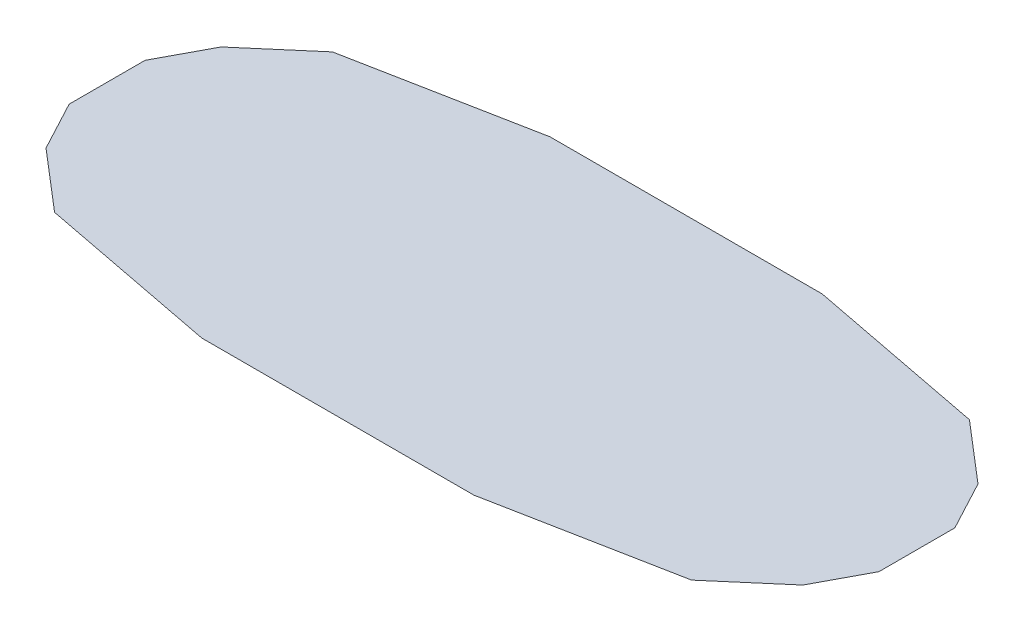
ISO-10303-21;
HEADER;
FILE_DESCRIPTION(('STEP AP214'),'2;1');
FILE_NAME('part.step','',(''),(''),'','','');
FILE_SCHEMA(('AUTOMOTIVE_DESIGN { 1 0 10303 214 1 1 1 1 }'));
ENDSEC;
DATA;
#1=APPLICATION_CONTEXT('core data for automotive mechanical design processes');
#2=APPLICATION_PROTOCOL_DEFINITION('international standard','automotive_design',2000,#1);
#3=PRODUCT_CONTEXT('',#1,'mechanical');
#4=PRODUCT('Part','Part','',(#3));
#5=PRODUCT_RELATED_PRODUCT_CATEGORY('part','',(#4));
#6=PRODUCT_DEFINITION_FORMATION('','',#4);
#7=PRODUCT_DEFINITION_CONTEXT('part definition',#1,'design');
#8=PRODUCT_DEFINITION('design','',#6,#7);
#9=PRODUCT_DEFINITION_SHAPE('','',#8);
#10=(LENGTH_UNIT() NAMED_UNIT(*) SI_UNIT(.MILLI.,.METRE.));
#11=(NAMED_UNIT(*) PLANE_ANGLE_UNIT() SI_UNIT($,.RADIAN.));
#12=(NAMED_UNIT(*) SI_UNIT($,.STERADIAN.) SOLID_ANGLE_UNIT());
#13=UNCERTAINTY_MEASURE_WITH_UNIT(LENGTH_MEASURE(1.E-05),#10,'distance_accuracy_value','');
#14=(GEOMETRIC_REPRESENTATION_CONTEXT(3) GLOBAL_UNCERTAINTY_ASSIGNED_CONTEXT((#13)) GLOBAL_UNIT_ASSIGNED_CONTEXT((#10,
#11,#12)) REPRESENTATION_CONTEXT('',''));
#15=CARTESIAN_POINT('',(0.,0.,0.));
#16=DIRECTION('',(0.,0.,1.));
#17=DIRECTION('',(1.,0.,0.));
#18=AXIS2_PLACEMENT_3D('',#15,#16,#17);
#19=CARTESIAN_POINT('',(0.,37.,0.));
#20=DIRECTION('',(0.,-1.,0.));
#21=DIRECTION('',(0.,0.,-1.));
#22=AXIS2_PLACEMENT_3D('',#19,#20,#21);
#23=PLANE('',#22);
#24=DIRECTION('',(-0.981820242082728,0.,0.18981309816926));
#25=VECTOR('',#24,1.);
#26=CARTESIAN_POINT('',(-163.761726677476,37.,-68.3356996693671));
#27=LINE('',#26,#25);
#28=CARTESIAN_POINT('',(-69.499566365944,37.,-86.5591910193771));
#29=VERTEX_POINT('',#28);
#30=CARTESIAN_POINT('',(-163.761726677476,37.,-68.3356996693671));
#31=VERTEX_POINT('',#30);
#32=EDGE_CURVE('E552',#29,#31,#27,.T.);
#33=ORIENTED_EDGE('',*,*,#32,.T.);
#34=DIRECTION('',(-0.759256602365296,0.,0.650791373455969));
#35=VECTOR('',#34,1.);
#36=CARTESIAN_POINT('',(-194.724634577507,37.,-41.7960643264831));
#37=LINE('',#36,#35);
#38=CARTESIAN_POINT('',(-194.724634577507,37.,-41.7960643264831));
#39=VERTEX_POINT('',#38);
#40=EDGE_CURVE('E263',#31,#39,#37,.T.);
#41=ORIENTED_EDGE('',*,*,#40,.T.);
#42=DIRECTION('',(-0.470588235294117,0.,0.882352941176471));
#43=VECTOR('',#42,1.);
#44=CARTESIAN_POINT('',(-208.389078498294,37.,-16.1752319750085));
#45=LINE('',#44,#43);
#46=CARTESIAN_POINT('',(-208.389078498294,37.,-16.1752319750085));
#47=VERTEX_POINT('',#46);
#48=EDGE_CURVE('E568',#39,#47,#45,.T.);
#49=ORIENTED_EDGE('',*,*,#48,.T.);
#50=DIRECTION('',(0.,0.,1.));
#51=VECTOR('',#50,1.);
#52=CARTESIAN_POINT('',(-208.389078498294,37.,23.0568499362544));
#53=LINE('',#52,#51);
#54=CARTESIAN_POINT('',(-208.389078498294,37.,23.0568499362544));
#55=VERTEX_POINT('',#54);
#56=EDGE_CURVE('E339',#47,#55,#53,.T.);
#57=ORIENTED_EDGE('',*,*,#56,.T.);
#58=DIRECTION('',(0.470588235294118,0.,0.88235294117647));
#59=VECTOR('',#58,1.);
#60=CARTESIAN_POINT('',(-194.724634577507,37.,48.6776822877289));
#61=LINE('',#60,#59);
#62=CARTESIAN_POINT('',(-194.724634577507,37.,48.6776822877289));
#63=VERTEX_POINT('',#62);
#64=EDGE_CURVE('E222',#55,#63,#61,.T.);
#65=ORIENTED_EDGE('',*,*,#64,.T.);
#66=DIRECTION('',(0.759256602365297,0.,0.650791373455968));
#67=VECTOR('',#66,1.);
#68=CARTESIAN_POINT('',(-163.761726677476,37.,75.2173176306129));
#69=LINE('',#68,#67);
#70=CARTESIAN_POINT('',(-163.761726677476,37.,75.2173176306129));
#71=VERTEX_POINT('',#70);
#72=EDGE_CURVE('E713',#63,#71,#69,.T.);
#73=ORIENTED_EDGE('',*,*,#72,.T.);
#74=DIRECTION('',(0.981820242082728,0.,0.18981309816926));
#75=VECTOR('',#74,1.);
#76=CARTESIAN_POINT('',(-69.4995663659439,37.,93.4408089806229));
#77=LINE('',#76,#75);
#78=CARTESIAN_POINT('',(-69.4995663659439,37.,93.4408089806229));
#79=VERTEX_POINT('',#78);
#80=EDGE_CURVE('E395',#71,#79,#77,.T.);
#81=ORIENTED_EDGE('',*,*,#80,.T.);
#82=DIRECTION('',(1.,0.,0.));
#83=VECTOR('',#82,1.);
#84=CARTESIAN_POINT('',(71.1104878676504,37.,93.4408089806229));
#85=LINE('',#84,#83);
#86=CARTESIAN_POINT('',(71.1104878676504,37.,93.4408089806229));
#87=VERTEX_POINT('',#86);
#88=EDGE_CURVE('E408',#79,#87,#85,.T.);
#89=ORIENTED_EDGE('',*,*,#88,.T.);
#90=DIRECTION('',(0.981820242082728,0.,-0.18981309816926));
#91=VECTOR('',#90,1.);
#92=CARTESIAN_POINT('',(165.372648179182,37.,75.2173176306128));
#93=LINE('',#92,#91);
#94=CARTESIAN_POINT('',(165.372648179182,37.,75.2173176306128));
#95=VERTEX_POINT('',#94);
#96=EDGE_CURVE('E422',#87,#95,#93,.T.);
#97=ORIENTED_EDGE('',*,*,#96,.T.);
#98=DIRECTION('',(0.759256602365296,0.,-0.650791373455969));
#99=VECTOR('',#98,1.);
#100=CARTESIAN_POINT('',(196.335556079214,37.,48.6776822877289));
#101=LINE('',#100,#99);
#102=CARTESIAN_POINT('',(196.335556079214,37.,48.6776822877289));
#103=VERTEX_POINT('',#102);
#104=EDGE_CURVE('E700',#95,#103,#101,.T.);
#105=ORIENTED_EDGE('',*,*,#104,.T.);
#106=DIRECTION('',(0.470588235294119,0.,-0.88235294117647));
#107=VECTOR('',#106,1.);
#108=CARTESIAN_POINT('',(210.,37.,23.0568499362544));
#109=LINE('',#108,#107);
#110=CARTESIAN_POINT('',(210.,37.,23.0568499362544));
#111=VERTEX_POINT('',#110);
#112=EDGE_CURVE('E696',#103,#111,#109,.T.);
#113=ORIENTED_EDGE('',*,*,#112,.T.);
#114=DIRECTION('',(0.,0.,-1.));
#115=VECTOR('',#114,1.);
#116=CARTESIAN_POINT('',(210.,37.,-16.1752319750085));
#117=LINE('',#116,#115);
#118=CARTESIAN_POINT('',(210.,37.,-16.1752319750085));
#119=VERTEX_POINT('',#118);
#120=EDGE_CURVE('E692',#111,#119,#117,.T.);
#121=ORIENTED_EDGE('',*,*,#120,.T.);
#122=DIRECTION('',(-0.470588235294117,0.,-0.882352941176471));
#123=VECTOR('',#122,1.);
#124=CARTESIAN_POINT('',(196.335556079214,37.,-41.7960643264832));
#125=LINE('',#124,#123);
#126=CARTESIAN_POINT('',(196.335556079214,37.,-41.7960643264832));
#127=VERTEX_POINT('',#126);
#128=EDGE_CURVE('E478',#119,#127,#125,.T.);
#129=ORIENTED_EDGE('',*,*,#128,.T.);
#130=DIRECTION('',(-0.759256602365297,0.,-0.650791373455969));
#131=VECTOR('',#130,1.);
#132=CARTESIAN_POINT('',(165.372648179182,37.,-68.3356996693672));
#133=LINE('',#132,#131);
#134=CARTESIAN_POINT('',(165.372648179182,37.,-68.3356996693672));
#135=VERTEX_POINT('',#134);
#136=EDGE_CURVE('E492',#127,#135,#133,.T.);
#137=ORIENTED_EDGE('',*,*,#136,.T.);
#138=DIRECTION('',(-0.981820242082728,0.,-0.18981309816926));
#139=VECTOR('',#138,1.);
#140=CARTESIAN_POINT('',(71.1104878676503,37.,-86.5591910193771));
#141=LINE('',#140,#139);
#142=CARTESIAN_POINT('',(71.1104878676503,37.,-86.5591910193771));
#143=VERTEX_POINT('',#142);
#144=EDGE_CURVE('E683',#135,#143,#141,.T.);
#145=ORIENTED_EDGE('',*,*,#144,.T.);
#146=DIRECTION('',(-1.,0.,0.));
#147=VECTOR('',#146,1.);
#148=CARTESIAN_POINT('',(-69.499566365944,37.,-86.5591910193771));
#149=LINE('',#148,#147);
#150=EDGE_CURVE('E540',#143,#29,#149,.T.);
#151=ORIENTED_EDGE('',*,*,#150,.T.);
#152=EDGE_LOOP('',(#33,#41,#49,#57,#65,#73,#81,#89,#97,#105,#113,#121,#129,#137,#145,#151));
#153=FACE_BOUND('',#152,.T.);
#154=ADVANCED_FACE('F79',(#153),#23,.F.);
#155=CARTESIAN_POINT('',(68.8356576594165,5.,34.2388799796404));
#156=CARTESIAN_POINT('',(165.372648179182,37.,75.2173176306128));
#157=CARTESIAN_POINT('',(73.2696124999855,5.,32.1710266010791));
#158=CARTESIAN_POINT('',(170.533132829187,37.,70.7940450734656));
#159=CARTESIAN_POINT('',(77.7035673405545,5.,30.1031732225177));
#160=CARTESIAN_POINT('',(175.693617479193,37.,66.3707725163183));
#161=CARTESIAN_POINT('',(86.5714770216925,5.,25.9674664653951));
#162=CARTESIAN_POINT('',(186.014586779203,37.,57.5242274020236));
#163=CARTESIAN_POINT('',(91.0054318622615,5.,23.8996130868338));
#164=CARTESIAN_POINT('',(191.175071429208,37.,53.1009548448763));
#165=CARTESIAN_POINT('',(95.4393867028304,5.,21.8317597082725));
#166=CARTESIAN_POINT('',(196.335556079214,37.,48.6776822877289));
#167=B_SPLINE_SURFACE_WITH_KNOTS('',3,1,((#155,#156),(#157,#158),(#159,#160),(#161,#162),(#163,
#164),(#165,#166)),.UNSPECIFIED.,.F.,.F.,.F.,(4,2,4),(2,2),(0.,0.5,1.),(0.,1.),.UNSPECIFIED.);
#168=DIRECTION('',(0.906286939212029,0.,-0.422662967166148));
#169=VECTOR('',#168,1.);
#170=CARTESIAN_POINT('',(95.4393867028304,5.,21.8317597082725));
#171=LINE('',#170,#169);
#172=CARTESIAN_POINT('',(95.4393867028304,5.,21.8317597082725));
#173=VERTEX_POINT('',#172);
#174=CARTESIAN_POINT('',(68.8356576594165,5.,34.2388799796404));
#175=VERTEX_POINT('',#174);
#176=EDGE_CURVE('E729',#173,#175,#171,.F.);
#177=DIRECTION('',(0.923953699431823,0.293039057523813,0.245840745345036));
#178=VECTOR('',#177,1.);
#179=CARTESIAN_POINT('',(145.887471391022,21.,35.2547209980007));
#180=LINE('',#179,#178);
#181=EDGE_CURVE('E262',#173,#103,#180,.T.);
#182=DIRECTION('',(-0.880428603121681,-0.291843729001737,-0.373728126647655));
#183=VECTOR('',#182,1.);
#184=CARTESIAN_POINT('',(117.104152919299,21.,54.7280988051266));
#185=LINE('',#184,#183);
#186=EDGE_CURVE('E258',#95,#175,#185,.T.);
#187=ORIENTED_EDGE('',*,*,#176,.F.);
#188=ORIENTED_EDGE('',*,*,#181,.T.);
#189=ORIENTED_EDGE('',*,*,#104,.F.);
#190=ORIENTED_EDGE('',*,*,#186,.T.);
#191=EDGE_LOOP('',(#187,#188,#189,#190));
#192=FACE_BOUND('',#191,.T.);
#193=ADVANCED_FACE('F587',(#192),#167,.T.);
#194=CARTESIAN_POINT('',(95.4393867028304,5.,21.8317597082725));
#195=CARTESIAN_POINT('',(196.335556079214,37.,48.6776822877289));
#196=CARTESIAN_POINT('',(96.4335469809849,5.,20.8177162245549));
#197=CARTESIAN_POINT('',(198.612963399345,37.,44.4075435624825));
#198=CARTESIAN_POINT('',(97.4277072591394,5.,19.8036727408373));
#199=CARTESIAN_POINT('',(200.890370719476,37.,40.1374048372365));
#200=CARTESIAN_POINT('',(99.4160278154484,5.,17.7755857734022));
#201=CARTESIAN_POINT('',(205.445185359738,37.,31.597127386745));
#202=CARTESIAN_POINT('',(100.410188093603,5.,16.7615422896846));
#203=CARTESIAN_POINT('',(207.722592679869,37.,27.3269886614995));
#204=CARTESIAN_POINT('',(101.404348371757,5.,15.747498805967));
#205=CARTESIAN_POINT('',(210.,37.,23.0568499362544));
#206=B_SPLINE_SURFACE_WITH_KNOTS('',3,1,((#194,#195),(#196,#197),(#198,#199),(#200,#201),(#202,
#203),(#204,#205)),.UNSPECIFIED.,.F.,.F.,.F.,(4,2,4),(2,2),(0.,0.5,1.),(0.,1.),.UNSPECIFIED.);
#207=DIRECTION('',(-0.700071410926058,0.,0.714072839144578));
#208=VECTOR('',#207,1.);
#209=CARTESIAN_POINT('',(95.4393867028304,5.,21.8317597082725));
#210=LINE('',#209,#208);
#211=CARTESIAN_POINT('',(101.404348371757,5.,15.747498805967));
#212=VERTEX_POINT('',#211);
#213=EDGE_CURVE('E753',#173,#212,#210,.F.);
#214=DIRECTION('',(0.957228679294572,0.282067626817021,0.0644291039653894));
#215=VECTOR('',#214,1.);
#216=CARTESIAN_POINT('',(155.702174185879,21.,19.4021743711107));
#217=LINE('',#216,#215);
#218=EDGE_CURVE('E269',#212,#111,#217,.T.);
#219=ORIENTED_EDGE('',*,*,#213,.T.);
#220=ORIENTED_EDGE('',*,*,#218,.T.);
#221=ORIENTED_EDGE('',*,*,#112,.F.);
#222=ORIENTED_EDGE('',*,*,#181,.F.);
#223=EDGE_LOOP('',(#219,#220,#221,#222));
#224=FACE_BOUND('',#223,.T.);
#225=ADVANCED_FACE('F442',(#224),#206,.T.);
#226=CARTESIAN_POINT('',(48.1968902849294,5.,40.5617393487029));
#227=CARTESIAN_POINT('',(71.1104878676504,37.,93.4408089806229));
#228=CARTESIAN_POINT('',(51.6366848473439,5.,39.5079294538592));
#229=CARTESIAN_POINT('',(86.8208479195725,37.,90.4035604222878));
#230=CARTESIAN_POINT('',(55.0764794097584,5.,38.4541195590154));
#231=CARTESIAN_POINT('',(102.531207971494,37.,87.3663118639528));
#232=CARTESIAN_POINT('',(61.9560685345874,5.,36.3464997693279));
#233=CARTESIAN_POINT('',(133.951928075338,37.,81.2918147472828));
#234=CARTESIAN_POINT('',(65.3958630970019,5.,35.2926898744842));
#235=CARTESIAN_POINT('',(149.66228812726,37.,78.2545661889478));
#236=CARTESIAN_POINT('',(68.8356576594165,5.,34.2388799796404));
#237=CARTESIAN_POINT('',(165.372648179182,37.,75.2173176306128));
#238=B_SPLINE_SURFACE_WITH_KNOTS('',3,1,((#226,#227),(#228,#229),(#230,#231),(#232,#233),(#234,
#235),(#236,#237)),.UNSPECIFIED.,.F.,.F.,.F.,(4,2,4),(2,2),(0.,0.5,1.),(0.,1.),.UNSPECIFIED.);
#239=DIRECTION('',(0.956136793860975,0.,-0.292920520662611));
#240=VECTOR('',#239,1.);
#241=CARTESIAN_POINT('',(68.8356576594165,5.,34.2388799796404));
#242=LINE('',#241,#240);
#243=CARTESIAN_POINT('',(48.1968902849294,5.,40.5617393487029));
#244=VERTEX_POINT('',#243);
#245=EDGE_CURVE('E98',#175,#244,#242,.F.);
#246=DIRECTION('',(0.347605747695051,0.485449038985903,0.80219042297763));
#247=VECTOR('',#246,1.);
#248=CARTESIAN_POINT('',(48.1968902849294,5.,40.5617393487029));
#249=LINE('',#248,#247);
#250=EDGE_CURVE('E249',#244,#87,#249,.T.);
#251=ORIENTED_EDGE('',*,*,#245,.F.);
#252=ORIENTED_EDGE('',*,*,#186,.F.);
#253=ORIENTED_EDGE('',*,*,#96,.F.);
#254=ORIENTED_EDGE('',*,*,#250,.F.);
#255=EDGE_LOOP('',(#251,#252,#253,#254));
#256=FACE_BOUND('',#255,.T.);
#257=ADVANCED_FACE('F429',(#256),#238,.T.);
#258=CARTESIAN_POINT('',(6.74593458341192,-22.8930988102223,0.));
#259=DIRECTION('',(-0.282654902629334,0.959221666779687,0.));
#260=DIRECTION('',(-0.959221666779688,-0.282654902629334,0.));
#261=AXIS2_PLACEMENT_3D('',#258,#259,#260);
#262=PLANE('',#261);
#263=DIRECTION('',(0.959214820678996,0.28265288528132,-0.00377812544875314));
#264=VECTOR('',#263,1.);
#265=CARTESIAN_POINT('',(101.404348371757,5.,-15.747498805967));
#266=LINE('',#265,#264);
#267=CARTESIAN_POINT('',(101.404348371757,5.,-15.747498805967));
#268=VERTEX_POINT('',#267);
#269=EDGE_CURVE('E275',#268,#119,#266,.T.);
#270=ORIENTED_EDGE('',*,*,#269,.T.);
#271=ORIENTED_EDGE('',*,*,#120,.F.);
#272=ORIENTED_EDGE('',*,*,#218,.F.);
#273=DIRECTION('',(0.,0.,-1.));
#274=VECTOR('',#273,1.);
#275=CARTESIAN_POINT('',(101.404348371757,5.,-15.747498805967));
#276=LINE('',#275,#274);
#277=EDGE_CURVE('E755',#268,#212,#276,.F.);
#278=ORIENTED_EDGE('',*,*,#277,.F.);
#279=EDGE_LOOP('',(#270,#271,#272,#278));
#280=FACE_BOUND('',#279,.T.);
#281=ADVANCED_FACE('F441',(#280),#262,.F.);
#282=CARTESIAN_POINT('',(101.404348371757,5.,-15.747498805967));
#283=CARTESIAN_POINT('',(210.,37.,-16.1752319750085));
#284=CARTESIAN_POINT('',(100.410188093603,5.,-16.7615422896846));
#285=CARTESIAN_POINT('',(207.722592679869,37.,-20.4453707002543));
#286=CARTESIAN_POINT('',(99.4160278154484,5.,-17.7755857734022));
#287=CARTESIAN_POINT('',(205.445185359738,37.,-24.7155094255001));
#288=CARTESIAN_POINT('',(97.4277072591394,5.,-19.8036727408373));
#289=CARTESIAN_POINT('',(200.890370719476,37.,-33.2557868759917));
#290=CARTESIAN_POINT('',(96.4335469809849,5.,-20.8177162245549));
#291=CARTESIAN_POINT('',(198.612963399345,37.,-37.5259256012374));
#292=CARTESIAN_POINT('',(95.4393867028304,5.,-21.8317597082725));
#293=CARTESIAN_POINT('',(196.335556079214,37.,-41.7960643264832));
#294=B_SPLINE_SURFACE_WITH_KNOTS('',3,1,((#282,#283),(#284,#285),(#286,#287),(#288,#289),(#290,
#291),(#292,#293)),.UNSPECIFIED.,.F.,.F.,.F.,(4,2,4),(2,2),(0.,0.5,1.),(0.,1.),.UNSPECIFIED.);
#295=DIRECTION('',(-0.700071410926058,0.,-0.714072839144578));
#296=VECTOR('',#295,1.);
#297=CARTESIAN_POINT('',(95.4393867028304,5.,-21.8317597082725));
#298=LINE('',#297,#296);
#299=CARTESIAN_POINT('',(95.4393867028304,5.,-21.8317597082725));
#300=VERTEX_POINT('',#299);
#301=EDGE_CURVE('E805',#300,#268,#298,.F.);
#302=DIRECTION('',(0.936692024413332,0.297079115753256,-0.185343061331459));
#303=VECTOR('',#302,1.);
#304=CARTESIAN_POINT('',(145.887471391022,21.,-31.8139120173778));
#305=LINE('',#304,#303);
#306=EDGE_CURVE('E281',#300,#127,#305,.T.);
#307=ORIENTED_EDGE('',*,*,#301,.F.);
#308=ORIENTED_EDGE('',*,*,#306,.T.);
#309=ORIENTED_EDGE('',*,*,#128,.F.);
#310=ORIENTED_EDGE('',*,*,#269,.F.);
#311=EDGE_LOOP('',(#307,#308,#309,#310));
#312=FACE_BOUND('',#311,.T.);
#313=ADVANCED_FACE('F455',(#312),#294,.T.);
#314=CARTESIAN_POINT('',(95.4393867028304,5.,-21.8317597082725));
#315=CARTESIAN_POINT('',(196.335556079214,37.,-41.7960643264832));
#316=CARTESIAN_POINT('',(91.0054318622615,5.,-23.8996130868338));
#317=CARTESIAN_POINT('',(191.175071429208,37.,-46.2193368836304));
#318=CARTESIAN_POINT('',(86.5714770216925,5.,-25.9674664653951));
#319=CARTESIAN_POINT('',(186.014586779203,37.,-50.6426094407777));
#320=CARTESIAN_POINT('',(77.7035673405544,5.,-30.1031732225178));
#321=CARTESIAN_POINT('',(175.693617479193,37.,-59.4891545550724));
#322=CARTESIAN_POINT('',(73.2696124999855,5.,-32.1710266010791));
#323=CARTESIAN_POINT('',(170.533132829188,37.,-63.9124271122198));
#324=CARTESIAN_POINT('',(68.8356576594165,5.,-34.2388799796404));
#325=CARTESIAN_POINT('',(165.372648179182,37.,-68.3356996693672));
#326=B_SPLINE_SURFACE_WITH_KNOTS('',3,1,((#314,#315),(#316,#317),(#318,#319),(#320,#321),(#322,
#323),(#324,#325)),.UNSPECIFIED.,.F.,.F.,.F.,(4,2,4),(2,2),(0.,0.5,1.),(0.,1.),.UNSPECIFIED.);
#327=DIRECTION('',(-0.906286939212029,0.,-0.422662967166148));
#328=VECTOR('',#327,1.);
#329=CARTESIAN_POINT('',(68.8356576594165,5.,-34.2388799796404));
#330=LINE('',#329,#328);
#331=CARTESIAN_POINT('',(68.8356576594165,5.,-34.2388799796404));
#332=VERTEX_POINT('',#331);
#333=EDGE_CURVE('E761',#332,#300,#330,.F.);
#334=DIRECTION('',(0.899977971619276,0.298323937143247,-0.317871796684458));
#335=VECTOR('',#334,1.);
#336=CARTESIAN_POINT('',(117.104152919299,21.,-51.2872898245038));
#337=LINE('',#336,#335);
#338=EDGE_CURVE('E758',#332,#135,#337,.T.);
#339=ORIENTED_EDGE('',*,*,#333,.F.);
#340=ORIENTED_EDGE('',*,*,#338,.T.);
#341=ORIENTED_EDGE('',*,*,#136,.F.);
#342=ORIENTED_EDGE('',*,*,#306,.F.);
#343=EDGE_LOOP('',(#339,#340,#341,#342));
#344=FACE_BOUND('',#343,.T.);
#345=ADVANCED_FACE('F498',(#344),#326,.T.);
#346=CARTESIAN_POINT('',(68.8356576594165,5.,-34.2388799796404));
#347=CARTESIAN_POINT('',(165.372648179182,37.,-68.3356996693672));
#348=CARTESIAN_POINT('',(65.3958630970019,5.,-35.2926898744842));
#349=CARTESIAN_POINT('',(149.66228812726,37.,-71.3729482277022));
#350=CARTESIAN_POINT('',(61.9560685345874,5.,-36.3464997693279));
#351=CARTESIAN_POINT('',(133.951928075338,37.,-74.4101967860371));
#352=CARTESIAN_POINT('',(55.0764794097584,5.,-38.4541195590154));
#353=CARTESIAN_POINT('',(102.531207971494,37.,-80.4846939027071));
#354=CARTESIAN_POINT('',(51.6366848473439,5.,-39.5079294538592));
#355=CARTESIAN_POINT('',(86.8208479195723,37.,-83.5219424610421));
#356=CARTESIAN_POINT('',(48.1968902849294,5.,-40.5617393487029));
#357=CARTESIAN_POINT('',(71.1104878676503,37.,-86.5591910193771));
#358=B_SPLINE_SURFACE_WITH_KNOTS('',3,1,((#346,#347),(#348,#349),(#350,#351),(#352,#353),(#354,
#355),(#356,#357)),.UNSPECIFIED.,.F.,.F.,.F.,(4,2,4),(2,2),(0.,0.5,1.),(0.,1.),.UNSPECIFIED.);
#359=DIRECTION('',(-0.956136793860975,0.,-0.292920520662611));
#360=VECTOR('',#359,1.);
#361=CARTESIAN_POINT('',(48.1968902849294,5.,-40.5617393487029));
#362=LINE('',#361,#360);
#363=CARTESIAN_POINT('',(48.1968902849294,5.00000000000001,-40.561739348703));
#364=VERTEX_POINT('',#363);
#365=EDGE_CURVE('E255',#364,#332,#362,.F.);
#366=DIRECTION('',(0.378502044947612,0.528597283538628,-0.759816500088053));
#367=VECTOR('',#366,1.);
#368=CARTESIAN_POINT('',(59.6536890762899,21.,-63.56046518404));
#369=LINE('',#368,#367);
#370=EDGE_CURVE('E759',#364,#143,#369,.T.);
#371=ORIENTED_EDGE('',*,*,#365,.F.);
#372=ORIENTED_EDGE('',*,*,#370,.T.);
#373=ORIENTED_EDGE('',*,*,#144,.F.);
#374=ORIENTED_EDGE('',*,*,#338,.F.);
#375=EDGE_LOOP('',(#371,#372,#373,#374));
#376=FACE_BOUND('',#375,.T.);
#377=ADVANCED_FACE('F509',(#376),#358,.T.);
#378=CARTESIAN_POINT('',(0.,-15.6459913675235,-10.8847709074274));
#379=DIRECTION('',(0.,0.820890370275903,0.57108580790306));
#380=DIRECTION('',(0.,-0.57108580790306,0.820890370275903));
#381=AXIS2_PLACEMENT_3D('',#378,#379,#380);
#382=PLANE('',#381);
#383=DIRECTION('',(-0.355362122624606,0.533810300674947,-0.767309797081372));
#384=VECTOR('',#383,1.);
#385=CARTESIAN_POINT('',(-48.1968902849294,5.,-40.5617393487029));
#386=LINE('',#385,#384);
#387=CARTESIAN_POINT('',(-48.1968902849294,5.,-40.5617393487029));
#388=VERTEX_POINT('',#387);
#389=EDGE_CURVE('E766',#388,#29,#386,.T.);
#390=ORIENTED_EDGE('',*,*,#389,.T.);
#391=ORIENTED_EDGE('',*,*,#150,.F.);
#392=ORIENTED_EDGE('',*,*,#370,.F.);
#393=DIRECTION('',(1.,0.,0.));
#394=VECTOR('',#393,1.);
#395=CARTESIAN_POINT('',(0.,4.99999999999999,-40.561739348703));
#396=LINE('',#395,#394);
#397=EDGE_CURVE('E12',#364,#388,#396,.F.);
#398=ORIENTED_EDGE('',*,*,#397,.T.);
#399=EDGE_LOOP('',(#390,#391,#392,#398));
#400=FACE_BOUND('',#399,.T.);
#401=ADVANCED_FACE('F519',(#400),#382,.F.);
#402=CARTESIAN_POINT('',(-48.1968902849294,5.,-40.5617393487029));
#403=CARTESIAN_POINT('',(-69.4995663659439,37.,-86.5591910193771));
#404=CARTESIAN_POINT('',(-51.6366848473439,5.,-39.5079294538592));
#405=CARTESIAN_POINT('',(-85.2099264178657,37.,-83.5219424610421));
#406=CARTESIAN_POINT('',(-55.0764794097584,5.,-38.4541195590154));
#407=CARTESIAN_POINT('',(-100.920286469788,37.,-80.4846939027071));
#408=CARTESIAN_POINT('',(-61.9560685345874,5.,-36.3464997693279));
#409=CARTESIAN_POINT('',(-132.341006573631,37.,-74.4101967860372));
#410=CARTESIAN_POINT('',(-65.3958630970019,5.,-35.2926898744842));
#411=CARTESIAN_POINT('',(-148.051366625554,37.,-71.3729482277021));
#412=CARTESIAN_POINT('',(-68.8356576594165,5.,-34.2388799796404));
#413=CARTESIAN_POINT('',(-163.761726677476,37.,-68.3356996693671));
#414=B_SPLINE_SURFACE_WITH_KNOTS('',3,1,((#402,#403),(#404,#405),(#406,#407),(#408,#409),(#410,
#411),(#412,#413)),.UNSPECIFIED.,.F.,.F.,.F.,(4,2,4),(2,2),(0.,0.5,1.),(0.,1.),.UNSPECIFIED.);
#415=DIRECTION('',(-0.956136793860975,0.,0.292920520662611));
#416=VECTOR('',#415,1.);
#417=CARTESIAN_POINT('',(-68.8356576594165,5.,-34.2388799796404));
#418=LINE('',#417,#416);
#419=CARTESIAN_POINT('',(-68.8356576594165,5.,-34.2388799796404));
#420=VERTEX_POINT('',#419);
#421=EDGE_CURVE('E90',#420,#388,#418,.F.);
#422=DIRECTION('',(-0.897065095367471,0.302404632875905,-0.322219882515866));
#423=VECTOR('',#422,1.);
#424=CARTESIAN_POINT('',(-116.298692168446,21.,-51.2872898245038));
#425=LINE('',#424,#423);
#426=EDGE_CURVE('E106',#420,#31,#425,.T.);
#427=ORIENTED_EDGE('',*,*,#421,.F.);
#428=ORIENTED_EDGE('',*,*,#426,.T.);
#429=ORIENTED_EDGE('',*,*,#32,.F.);
#430=ORIENTED_EDGE('',*,*,#389,.F.);
#431=EDGE_LOOP('',(#427,#428,#429,#430));
#432=FACE_BOUND('',#431,.T.);
#433=ADVANCED_FACE('F307',(#432),#414,.T.);
#434=CARTESIAN_POINT('',(-68.8356576594165,5.,-34.2388799796404));
#435=CARTESIAN_POINT('',(-163.761726677476,37.,-68.3356996693671));
#436=CARTESIAN_POINT('',(-73.2696124999855,5.,-32.1710266010791));
#437=CARTESIAN_POINT('',(-168.922211327481,37.,-63.9124271122201));
#438=CARTESIAN_POINT('',(-77.7035673405545,5.,-30.1031732225177));
#439=CARTESIAN_POINT('',(-174.082695977486,37.,-59.4891545550729));
#440=CARTESIAN_POINT('',(-86.5714770216925,5.,-25.9674664653951));
#441=CARTESIAN_POINT('',(-184.403665277496,37.,-50.6426094407782));
#442=CARTESIAN_POINT('',(-91.0054318622615,5.,-23.8996130868338));
#443=CARTESIAN_POINT('',(-189.564149927502,37.,-46.2193368836308));
#444=CARTESIAN_POINT('',(-95.4393867028304,5.,-21.8317597082725));
#445=CARTESIAN_POINT('',(-194.724634577507,37.,-41.7960643264831));
#446=B_SPLINE_SURFACE_WITH_KNOTS('',3,1,((#434,#435),(#436,#437),(#438,#439),(#440,#441),(#442,
#443),(#444,#445)),.UNSPECIFIED.,.F.,.F.,.F.,(4,2,4),(2,2),(0.,0.5,1.),(0.,1.),.UNSPECIFIED.);
#447=DIRECTION('',(-0.906286939212029,0.,0.422662967166148));
#448=VECTOR('',#447,1.);
#449=CARTESIAN_POINT('',(-95.4393867028304,5.,-21.8317597082725));
#450=LINE('',#449,#448);
#451=CARTESIAN_POINT('',(-95.4393867028304,5.,-21.8317597082725));
#452=VERTEX_POINT('',#451);
#453=EDGE_CURVE('E789',#452,#420,#450,.F.);
#454=DIRECTION('',(-0.934819142263983,0.301295642532985,-0.187973687114626));
#455=VECTOR('',#454,1.);
#456=CARTESIAN_POINT('',(-145.082010640169,21.,-31.8139120173778));
#457=LINE('',#456,#455);
#458=EDGE_CURVE('E231',#452,#39,#457,.T.);
#459=ORIENTED_EDGE('',*,*,#453,.F.);
#460=ORIENTED_EDGE('',*,*,#458,.T.);
#461=ORIENTED_EDGE('',*,*,#40,.F.);
#462=ORIENTED_EDGE('',*,*,#426,.F.);
#463=EDGE_LOOP('',(#459,#460,#461,#462));
#464=FACE_BOUND('',#463,.T.);
#465=ADVANCED_FACE('F294',(#464),#446,.T.);
#466=CARTESIAN_POINT('',(-95.4393867028304,5.,-21.8317597082725));
#467=CARTESIAN_POINT('',(-194.724634577507,37.,-41.7960643264831));
#468=CARTESIAN_POINT('',(-96.4335469809849,5.,-20.8177162245549));
#469=CARTESIAN_POINT('',(-197.002041897638,37.,-37.5259256012373));
#470=CARTESIAN_POINT('',(-97.4277072591394,5.,-19.8036727408373));
#471=CARTESIAN_POINT('',(-199.279449217769,37.,-33.2557868759915));
#472=CARTESIAN_POINT('',(-99.4160278154484,5.,-17.7755857734022));
#473=CARTESIAN_POINT('',(-203.834263858031,37.,-24.7155094255));
#474=CARTESIAN_POINT('',(-100.410188093603,5.,-16.7615422896846));
#475=CARTESIAN_POINT('',(-206.111671178162,37.,-20.4453707002542));
#476=CARTESIAN_POINT('',(-101.404348371757,5.,-15.747498805967));
#477=CARTESIAN_POINT('',(-208.389078498294,37.,-16.1752319750085));
#478=B_SPLINE_SURFACE_WITH_KNOTS('',3,1,((#466,#467),(#468,#469),(#470,#471),(#472,#473),(#474,
#475),(#476,#477)),.UNSPECIFIED.,.F.,.F.,.F.,(4,2,4),(2,2),(0.,0.5,1.),(0.,1.),.UNSPECIFIED.);
#479=DIRECTION('',(-0.700071410926058,0.,0.714072839144578));
#480=VECTOR('',#479,1.);
#481=CARTESIAN_POINT('',(-101.404348371757,5.,-15.747498805967));
#482=LINE('',#481,#480);
#483=CARTESIAN_POINT('',(-101.404348371757,5.,-15.747498805967));
#484=VERTEX_POINT('',#483);
#485=EDGE_CURVE('E218',#484,#452,#482,.F.);
#486=DIRECTION('',(-0.958054116617773,0.286561752275379,-0.00383037395083846));
#487=VECTOR('',#486,1.);
#488=CARTESIAN_POINT('',(-154.896713435025,21.,-15.9613653904878));
#489=LINE('',#488,#487);
#490=EDGE_CURVE('E216',#484,#47,#489,.T.);
#491=ORIENTED_EDGE('',*,*,#485,.F.);
#492=ORIENTED_EDGE('',*,*,#490,.T.);
#493=ORIENTED_EDGE('',*,*,#48,.F.);
#494=ORIENTED_EDGE('',*,*,#458,.F.);
#495=EDGE_LOOP('',(#491,#492,#493,#494));
#496=FACE_BOUND('',#495,.T.);
#497=ADVANCED_FACE('F306',(#496),#478,.T.);
#498=CARTESIAN_POINT('',(-6.95447926006433,-23.250721462768,0.));
#499=DIRECTION('',(0.286563854481798,0.958061144867349,0.));
#500=DIRECTION('',(-0.958061144867349,0.286563854481798,0.));
#501=AXIS2_PLACEMENT_3D('',#498,#499,#500);
#502=PLANE('',#501);
#503=DIRECTION('',(-0.956015308349185,0.285951928195647,0.0653163452988969));
#504=VECTOR('',#503,1.);
#505=CARTESIAN_POINT('',(-101.404348371757,5.,15.747498805967));
#506=LINE('',#505,#504);
#507=CARTESIAN_POINT('',(-101.404348371757,5.,15.747498805967));
#508=VERTEX_POINT('',#507);
#509=EDGE_CURVE('E214',#508,#55,#506,.T.);
#510=ORIENTED_EDGE('',*,*,#509,.T.);
#511=ORIENTED_EDGE('',*,*,#56,.F.);
#512=ORIENTED_EDGE('',*,*,#490,.F.);
#513=DIRECTION('',(0.,0.,1.));
#514=VECTOR('',#513,1.);
#515=CARTESIAN_POINT('',(-101.404348371757,5.,0.));
#516=LINE('',#515,#514);
#517=EDGE_CURVE('E199',#484,#508,#516,.T.);
#518=ORIENTED_EDGE('',*,*,#517,.T.);
#519=EDGE_LOOP('',(#510,#511,#512,#518));
#520=FACE_BOUND('',#519,.T.);
#521=ADVANCED_FACE('F212',(#520),#502,.F.);
#522=CARTESIAN_POINT('',(-101.404348371757,5.,15.747498805967));
#523=CARTESIAN_POINT('',(-208.389078498294,37.,23.0568499362544));
#524=CARTESIAN_POINT('',(-100.410188093603,5.,16.7615422896846));
#525=CARTESIAN_POINT('',(-206.111671178162,37.,27.3269886615001));
#526=CARTESIAN_POINT('',(-99.4160278154484,5.,17.7755857734022));
#527=CARTESIAN_POINT('',(-203.834263858031,37.,31.5971273867458));
#528=CARTESIAN_POINT('',(-97.4277072591394,5.,19.8036727408373));
#529=CARTESIAN_POINT('',(-199.279449217769,37.,40.1374048372373));
#530=CARTESIAN_POINT('',(-96.4335469809849,5.,20.8177162245549));
#531=CARTESIAN_POINT('',(-197.002041897638,37.,44.4075435624831));
#532=CARTESIAN_POINT('',(-95.4393867028304,5.,21.8317597082725));
#533=CARTESIAN_POINT('',(-194.724634577507,37.,48.6776822877289));
#534=B_SPLINE_SURFACE_WITH_KNOTS('',3,1,((#522,#523),(#524,#525),(#526,#527),(#528,#529),(#530,
#531),(#532,#533)),.UNSPECIFIED.,.F.,.F.,.F.,(4,2,4),(2,2),(0.,0.5,1.),(0.,1.),.UNSPECIFIED.);
#535=DIRECTION('',(0.700071410926058,0.,0.714072839144578));
#536=VECTOR('',#535,1.);
#537=CARTESIAN_POINT('',(-95.4393867028304,5.,21.8317597082725));
#538=LINE('',#537,#536);
#539=CARTESIAN_POINT('',(-95.4393867028304,5.,21.8317597082725));
#540=VERTEX_POINT('',#539);
#541=EDGE_CURVE('E196',#540,#508,#538,.F.);
#542=DIRECTION('',(-0.921750438077738,0.297083551180928,0.249233812957287));
#543=VECTOR('',#542,1.);
#544=CARTESIAN_POINT('',(-145.082010640169,21.,35.2547209980007));
#545=LINE('',#544,#543);
#546=EDGE_CURVE('E225',#540,#63,#545,.T.);
#547=ORIENTED_EDGE('',*,*,#541,.F.);
#548=ORIENTED_EDGE('',*,*,#546,.T.);
#549=ORIENTED_EDGE('',*,*,#64,.F.);
#550=ORIENTED_EDGE('',*,*,#509,.F.);
#551=EDGE_LOOP('',(#547,#548,#549,#550));
#552=FACE_BOUND('',#551,.T.);
#553=ADVANCED_FACE('F221',(#552),#534,.T.);
#554=CARTESIAN_POINT('',(-95.4393867028304,5.,21.8317597082725));
#555=CARTESIAN_POINT('',(-194.724634577507,37.,48.6776822877289));
#556=CARTESIAN_POINT('',(-91.0054318622615,5.,23.8996130868338));
#557=CARTESIAN_POINT('',(-189.564149927502,37.,53.1009548448762));
#558=CARTESIAN_POINT('',(-86.5714770216925,5.,25.9674664653951));
#559=CARTESIAN_POINT('',(-184.403665277497,37.,57.5242274020235));
#560=CARTESIAN_POINT('',(-77.7035673405544,5.,30.1031732225178));
#561=CARTESIAN_POINT('',(-174.082695977486,37.,66.3707725163182));
#562=CARTESIAN_POINT('',(-73.2696124999855,5.,32.1710266010791));
#563=CARTESIAN_POINT('',(-168.922211327481,37.,70.7940450734655));
#564=CARTESIAN_POINT('',(-68.8356576594165,5.,34.2388799796404));
#565=CARTESIAN_POINT('',(-163.761726677476,37.,75.2173176306129));
#566=B_SPLINE_SURFACE_WITH_KNOTS('',3,1,((#554,#555),(#556,#557),(#558,#559),(#560,#561),(#562,
#563),(#564,#565)),.UNSPECIFIED.,.F.,.F.,.F.,(4,2,4),(2,2),(0.,0.5,1.),(0.,1.),.UNSPECIFIED.);
#567=DIRECTION('',(-0.906286939212029,0.,-0.422662967166148));
#568=VECTOR('',#567,1.);
#569=CARTESIAN_POINT('',(-95.4393867028304,5.,21.8317597082725));
#570=LINE('',#569,#568);
#571=CARTESIAN_POINT('',(-68.8356576594165,5.,34.2388799796404));
#572=VERTEX_POINT('',#571);
#573=EDGE_CURVE('E202',#540,#572,#570,.F.);
#574=DIRECTION('',(-0.877060086558635,0.29566085544464,0.37861624783348));
#575=VECTOR('',#574,1.);
#576=CARTESIAN_POINT('',(-116.298692168446,21.,54.7280988051267));
#577=LINE('',#576,#575);
#578=EDGE_CURVE('E229',#572,#71,#577,.T.);
#579=ORIENTED_EDGE('',*,*,#573,.T.);
#580=ORIENTED_EDGE('',*,*,#578,.T.);
#581=ORIENTED_EDGE('',*,*,#72,.F.);
#582=ORIENTED_EDGE('',*,*,#546,.F.);
#583=EDGE_LOOP('',(#579,#580,#581,#582));
#584=FACE_BOUND('',#583,.T.);
#585=ADVANCED_FACE('F363',(#584),#566,.T.);
#586=CARTESIAN_POINT('',(-68.8356576594165,5.,34.2388799796404));
#587=CARTESIAN_POINT('',(-163.761726677476,37.,75.2173176306129));
#588=CARTESIAN_POINT('',(-65.3958630970019,5.,35.2926898744842));
#589=CARTESIAN_POINT('',(-148.051366625554,37.,78.2545661889479));
#590=CARTESIAN_POINT('',(-61.9560685345874,5.,36.3464997693279));
#591=CARTESIAN_POINT('',(-132.341006573632,37.,81.2918147472829));
#592=CARTESIAN_POINT('',(-55.0764794097584,5.,38.4541195590154));
#593=CARTESIAN_POINT('',(-100.920286469788,37.,87.3663118639529));
#594=CARTESIAN_POINT('',(-51.6366848473439,5.,39.5079294538592));
#595=CARTESIAN_POINT('',(-85.2099264178659,37.,90.4035604222879));
#596=CARTESIAN_POINT('',(-48.1968902849294,5.,40.5617393487029));
#597=CARTESIAN_POINT('',(-69.4995663659439,37.,93.4408089806229));
#598=B_SPLINE_SURFACE_WITH_KNOTS('',3,1,((#586,#587),(#588,#589),(#590,#591),(#592,#593),(#594,
#595),(#596,#597)),.UNSPECIFIED.,.F.,.F.,.F.,(4,2,4),(2,2),(0.,0.5,1.),(0.,1.),.UNSPECIFIED.);
#599=DIRECTION('',(-0.956136793860975,0.,-0.292920520662611));
#600=VECTOR('',#599,1.);
#601=CARTESIAN_POINT('',(-68.8356576594165,5.,34.2388799796404));
#602=LINE('',#601,#600);
#603=CARTESIAN_POINT('',(-48.1968902849294,5.,40.561739348703));
#604=VERTEX_POINT('',#603);
#605=EDGE_CURVE('E84',#572,#604,#602,.F.);
#606=DIRECTION('',(-0.325849383861368,0.489477483669609,0.808847310694444));
#607=VECTOR('',#606,1.);
#608=CARTESIAN_POINT('',(-58.8482283254367,21.,67.0012741646629));
#609=LINE('',#608,#607);
#610=EDGE_CURVE('E243',#604,#79,#609,.T.);
#611=ORIENTED_EDGE('',*,*,#605,.T.);
#612=ORIENTED_EDGE('',*,*,#610,.T.);
#613=ORIENTED_EDGE('',*,*,#80,.F.);
#614=ORIENTED_EDGE('',*,*,#578,.F.);
#615=EDGE_LOOP('',(#611,#612,#613,#614));
#616=FACE_BOUND('',#615,.T.);
#617=ADVANCED_FACE('F373',(#616),#598,.T.);
#618=CARTESIAN_POINT('',(0.,-14.3067960811413,8.65782015045449));
#619=DIRECTION('',(0.,0.855541306097265,-0.5177345589792));
#620=DIRECTION('',(0.,0.5177345589792,0.855541306097265));
#621=AXIS2_PLACEMENT_3D('',#618,#619,#620);
#622=PLANE('',#621);
#623=ORIENTED_EDGE('',*,*,#250,.T.);
#624=ORIENTED_EDGE('',*,*,#88,.F.);
#625=ORIENTED_EDGE('',*,*,#610,.F.);
#626=DIRECTION('',(1.,0.,0.));
#627=VECTOR('',#626,1.);
#628=CARTESIAN_POINT('',(48.1968902849294,5.,40.5617393487029));
#629=LINE('',#628,#627);
#630=EDGE_CURVE('E725',#244,#604,#629,.F.);
#631=ORIENTED_EDGE('',*,*,#630,.F.);
#632=EDGE_LOOP('',(#623,#624,#625,#631));
#633=FACE_BOUND('',#632,.T.);
#634=ADVANCED_FACE('F81',(#633),#622,.F.);
#635=CARTESIAN_POINT('',(-101.404348371757,5.,100.));
#636=DIRECTION('',(0.,1.,0.));
#637=DIRECTION('',(0.,0.,1.));
#638=AXIS2_PLACEMENT_3D('',#635,#636,#637);
#639=PLANE('',#638);
#640=ORIENTED_EDGE('',*,*,#365,.T.);
#641=ORIENTED_EDGE('',*,*,#333,.T.);
#642=ORIENTED_EDGE('',*,*,#301,.T.);
#643=ORIENTED_EDGE('',*,*,#277,.T.);
#644=ORIENTED_EDGE('',*,*,#213,.F.);
#645=ORIENTED_EDGE('',*,*,#176,.T.);
#646=ORIENTED_EDGE('',*,*,#245,.T.);
#647=ORIENTED_EDGE('',*,*,#630,.T.);
#648=ORIENTED_EDGE('',*,*,#605,.F.);
#649=ORIENTED_EDGE('',*,*,#573,.F.);
#650=ORIENTED_EDGE('',*,*,#541,.T.);
#651=ORIENTED_EDGE('',*,*,#517,.F.);
#652=ORIENTED_EDGE('',*,*,#485,.T.);
#653=ORIENTED_EDGE('',*,*,#453,.T.);
#654=ORIENTED_EDGE('',*,*,#421,.T.);
#655=ORIENTED_EDGE('',*,*,#397,.F.);
#656=EDGE_LOOP('',(#640,#641,#642,#643,#644,#645,#646,#647,#648,#649,#650,#651,#652,#653,#654,#655));
#657=FACE_BOUND('',#656,.T.);
#658=ADVANCED_FACE('F198',(#657),#639,.F.);
#659=CLOSED_SHELL('',(#154,#193,#225,#257,#281,#313,#345,#377,#401,#433,#465,#497,#521,#553,
#585,#617,#634,#658));
#660=MANIFOLD_SOLID_BREP('B2',#659);
#661=ADVANCED_BREP_SHAPE_REPRESENTATION('',(#18,#660),#14);
#662=SHAPE_DEFINITION_REPRESENTATION(#9,#661);
ENDSEC;
END-ISO-10303-21;
